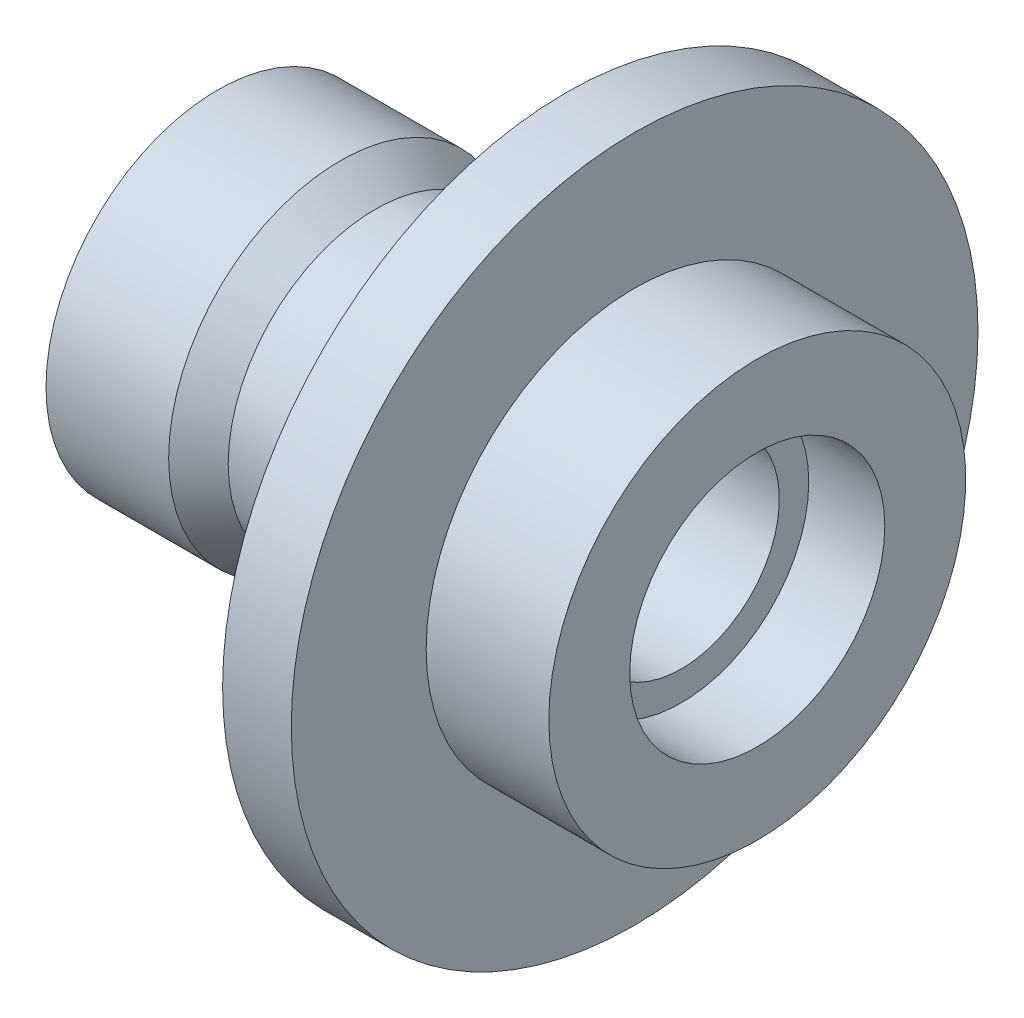
ISO-10303-21;
HEADER;
FILE_DESCRIPTION(('STEP AP214'),'2;1');
FILE_NAME('part.step','',(''),(''),'','','');
FILE_SCHEMA(('AUTOMOTIVE_DESIGN { 1 0 10303 214 1 1 1 1 }'));
ENDSEC;
DATA;
#1=APPLICATION_CONTEXT('core data for automotive mechanical design processes');
#2=APPLICATION_PROTOCOL_DEFINITION('international standard','automotive_design',2000,#1);
#3=PRODUCT_CONTEXT('',#1,'mechanical');
#4=PRODUCT('Part','Part','',(#3));
#5=PRODUCT_RELATED_PRODUCT_CATEGORY('part','',(#4));
#6=PRODUCT_DEFINITION_FORMATION('','',#4);
#7=PRODUCT_DEFINITION_CONTEXT('part definition',#1,'design');
#8=PRODUCT_DEFINITION('design','',#6,#7);
#9=PRODUCT_DEFINITION_SHAPE('','',#8);
#10=(LENGTH_UNIT() NAMED_UNIT(*) SI_UNIT(.MILLI.,.METRE.));
#11=(NAMED_UNIT(*) PLANE_ANGLE_UNIT() SI_UNIT($,.RADIAN.));
#12=(NAMED_UNIT(*) SI_UNIT($,.STERADIAN.) SOLID_ANGLE_UNIT());
#13=UNCERTAINTY_MEASURE_WITH_UNIT(LENGTH_MEASURE(1.E-05),#10,'distance_accuracy_value','');
#14=(GEOMETRIC_REPRESENTATION_CONTEXT(3) GLOBAL_UNCERTAINTY_ASSIGNED_CONTEXT((#13)) GLOBAL_UNIT_ASSIGNED_CONTEXT((#10,
#11,#12)) REPRESENTATION_CONTEXT('',''));
#15=CARTESIAN_POINT('',(0.,0.,0.));
#16=DIRECTION('',(0.,0.,1.));
#17=DIRECTION('',(1.,0.,0.));
#18=AXIS2_PLACEMENT_3D('',#15,#16,#17);
#19=CARTESIAN_POINT('',(0.,0.,0.));
#20=DIRECTION('',(-1.,0.,0.));
#21=DIRECTION('',(0.,0.,1.));
#22=AXIS2_PLACEMENT_3D('',#19,#20,#21);
#23=CYLINDRICAL_SURFACE('',#22,23.5);
#24=CARTESIAN_POINT('',(-27.2254716981132,0.,0.));
#25=DIRECTION('',(-1.,0.,0.));
#26=DIRECTION('',(0.,0.,1.));
#27=AXIS2_PLACEMENT_3D('',#24,#25,#26);
#28=CIRCLE('',#27,23.5);
#29=CARTESIAN_POINT('',(-27.2254716981132,0.,23.5));
#30=VERTEX_POINT('',#29);
#31=EDGE_CURVE('E56',#30,#30,#28,.T.);
#32=ORIENTED_EDGE('',*,*,#31,.F.);
#33=EDGE_LOOP('',(#32));
#34=FACE_BOUND('',#33,.T.);
#35=CARTESIAN_POINT('',(-41.2254716981132,0.,0.));
#36=DIRECTION('',(-1.,0.,0.));
#37=DIRECTION('',(0.,0.,1.));
#38=AXIS2_PLACEMENT_3D('',#35,#36,#37);
#39=CIRCLE('',#38,23.5);
#40=CARTESIAN_POINT('',(-41.2254716981132,0.,23.5));
#41=VERTEX_POINT('',#40);
#42=EDGE_CURVE('E122',#41,#41,#39,.T.);
#43=ORIENTED_EDGE('',*,*,#42,.T.);
#44=EDGE_LOOP('',(#43));
#45=FACE_BOUND('',#44,.T.);
#46=ADVANCED_FACE('F40',(#34,#45),#23,.F.);
#47=CARTESIAN_POINT('',(-27.2254716981132,0.,0.));
#48=DIRECTION('',(1.,0.,0.));
#49=DIRECTION('',(0.,0.,-1.));
#50=AXIS2_PLACEMENT_3D('',#47,#48,#49);
#51=PLANE('',#50);
#52=CARTESIAN_POINT('',(-27.2254716981132,0.,0.));
#53=DIRECTION('',(-1.,0.,0.));
#54=DIRECTION('',(0.,0.,1.));
#55=AXIS2_PLACEMENT_3D('',#52,#53,#54);
#56=CIRCLE('',#55,20.);
#57=CARTESIAN_POINT('',(-27.2254716981132,0.,20.));
#58=VERTEX_POINT('',#57);
#59=EDGE_CURVE('E64',#58,#58,#56,.T.);
#60=ORIENTED_EDGE('',*,*,#59,.F.);
#61=EDGE_LOOP('',(#60));
#62=FACE_BOUND('',#61,.T.);
#63=ORIENTED_EDGE('',*,*,#31,.T.);
#64=EDGE_LOOP('',(#63));
#65=FACE_BOUND('',#64,.T.);
#66=ADVANCED_FACE('F181',(#62,#65),#51,.F.);
#67=CARTESIAN_POINT('',(0.,0.,0.));
#68=DIRECTION('',(-1.,0.,0.));
#69=DIRECTION('',(0.,0.,1.));
#70=AXIS2_PLACEMENT_3D('',#67,#68,#69);
#71=CYLINDRICAL_SURFACE('',#70,20.);
#72=CARTESIAN_POINT('',(49.4245283018868,0.,0.));
#73=DIRECTION('',(-1.,0.,0.));
#74=DIRECTION('',(0.,0.,1.));
#75=AXIS2_PLACEMENT_3D('',#72,#73,#74);
#76=CIRCLE('',#75,20.);
#77=CARTESIAN_POINT('',(49.4245283018868,0.,20.));
#78=VERTEX_POINT('',#77);
#79=EDGE_CURVE('E70',#78,#78,#76,.T.);
#80=ORIENTED_EDGE('',*,*,#79,.F.);
#81=EDGE_LOOP('',(#80));
#82=FACE_BOUND('',#81,.T.);
#83=ORIENTED_EDGE('',*,*,#59,.T.);
#84=EDGE_LOOP('',(#83));
#85=FACE_BOUND('',#84,.T.);
#86=ADVANCED_FACE('F186',(#82,#85),#71,.F.);
#87=CARTESIAN_POINT('',(49.4245283018868,0.,0.));
#88=DIRECTION('',(-1.,0.,0.));
#89=DIRECTION('',(0.,0.,1.));
#90=AXIS2_PLACEMENT_3D('',#87,#88,#89);
#91=PLANE('',#90);
#92=CARTESIAN_POINT('',(49.4245283018868,0.,0.));
#93=DIRECTION('',(-1.,0.,0.));
#94=DIRECTION('',(0.,0.,1.));
#95=AXIS2_PLACEMENT_3D('',#92,#93,#94);
#96=CIRCLE('',#95,26.);
#97=CARTESIAN_POINT('',(49.4245283018868,0.,26.));
#98=VERTEX_POINT('',#97);
#99=EDGE_CURVE('E74',#98,#98,#96,.T.);
#100=ORIENTED_EDGE('',*,*,#99,.F.);
#101=EDGE_LOOP('',(#100));
#102=FACE_BOUND('',#101,.T.);
#103=ORIENTED_EDGE('',*,*,#79,.T.);
#104=EDGE_LOOP('',(#103));
#105=FACE_BOUND('',#104,.T.);
#106=ADVANCED_FACE('F193',(#102,#105),#91,.F.);
#107=CARTESIAN_POINT('',(0.,0.,0.));
#108=DIRECTION('',(-1.,0.,0.));
#109=DIRECTION('',(0.,0.,1.));
#110=AXIS2_PLACEMENT_3D('',#107,#108,#109);
#111=CYLINDRICAL_SURFACE('',#110,26.);
#112=CARTESIAN_POINT('',(64.9245283018868,0.,0.));
#113=DIRECTION('',(-1.,0.,0.));
#114=DIRECTION('',(0.,0.,1.));
#115=AXIS2_PLACEMENT_3D('',#112,#113,#114);
#116=CIRCLE('',#115,26.);
#117=CARTESIAN_POINT('',(64.9245283018868,0.,26.));
#118=VERTEX_POINT('',#117);
#119=EDGE_CURVE('E77',#118,#118,#116,.T.);
#120=ORIENTED_EDGE('',*,*,#119,.F.);
#121=EDGE_LOOP('',(#120));
#122=FACE_BOUND('',#121,.T.);
#123=ORIENTED_EDGE('',*,*,#99,.T.);
#124=EDGE_LOOP('',(#123));
#125=FACE_BOUND('',#124,.T.);
#126=ADVANCED_FACE('F197',(#122,#125),#111,.F.);
#127=CARTESIAN_POINT('',(64.9245283018868,0.,0.));
#128=DIRECTION('',(-1.,0.,0.));
#129=DIRECTION('',(0.,0.,1.));
#130=AXIS2_PLACEMENT_3D('',#127,#128,#129);
#131=PLANE('',#130);
#132=CARTESIAN_POINT('',(64.9245283018868,0.,0.));
#133=DIRECTION('',(-1.,0.,0.));
#134=DIRECTION('',(0.,0.,1.));
#135=AXIS2_PLACEMENT_3D('',#132,#133,#134);
#136=CIRCLE('',#135,42.5);
#137=CARTESIAN_POINT('',(64.9245283018868,0.,42.5));
#138=VERTEX_POINT('',#137);
#139=EDGE_CURVE('E80',#138,#138,#136,.T.);
#140=ORIENTED_EDGE('',*,*,#139,.F.);
#141=EDGE_LOOP('',(#140));
#142=FACE_BOUND('',#141,.T.);
#143=ORIENTED_EDGE('',*,*,#119,.T.);
#144=EDGE_LOOP('',(#143));
#145=FACE_BOUND('',#144,.T.);
#146=ADVANCED_FACE('F201',(#142,#145),#131,.F.);
#147=CARTESIAN_POINT('',(0.,0.,0.));
#148=DIRECTION('',(-1.,0.,0.));
#149=DIRECTION('',(0.,0.,1.));
#150=AXIS2_PLACEMENT_3D('',#147,#148,#149);
#151=CYLINDRICAL_SURFACE('',#150,42.5);
#152=CARTESIAN_POINT('',(39.9245283018868,0.,0.));
#153=DIRECTION('',(-1.,0.,0.));
#154=DIRECTION('',(0.,0.,1.));
#155=AXIS2_PLACEMENT_3D('',#152,#153,#154);
#156=CIRCLE('',#155,42.5);
#157=CARTESIAN_POINT('',(39.9245283018868,0.,42.5));
#158=VERTEX_POINT('',#157);
#159=EDGE_CURVE('E83',#158,#158,#156,.T.);
#160=ORIENTED_EDGE('',*,*,#159,.F.);
#161=EDGE_LOOP('',(#160));
#162=FACE_BOUND('',#161,.T.);
#163=ORIENTED_EDGE('',*,*,#139,.T.);
#164=EDGE_LOOP('',(#163));
#165=FACE_BOUND('',#164,.T.);
#166=ADVANCED_FACE('F205',(#162,#165),#151,.T.);
#167=CARTESIAN_POINT('',(39.9245283018868,0.,0.));
#168=DIRECTION('',(-1.,0.,0.));
#169=DIRECTION('',(0.,0.,1.));
#170=AXIS2_PLACEMENT_3D('',#167,#168,#169);
#171=PLANE('',#170);
#172=CARTESIAN_POINT('',(39.9245283018868,0.,0.));
#173=DIRECTION('',(-1.,0.,0.));
#174=DIRECTION('',(0.,0.,1.));
#175=AXIS2_PLACEMENT_3D('',#172,#173,#174);
#176=CIRCLE('',#175,70.);
#177=CARTESIAN_POINT('',(39.9245283018868,0.,70.));
#178=VERTEX_POINT('',#177);
#179=EDGE_CURVE('E86',#178,#178,#176,.T.);
#180=ORIENTED_EDGE('',*,*,#179,.F.);
#181=EDGE_LOOP('',(#180));
#182=FACE_BOUND('',#181,.T.);
#183=ORIENTED_EDGE('',*,*,#159,.T.);
#184=EDGE_LOOP('',(#183));
#185=FACE_BOUND('',#184,.T.);
#186=ADVANCED_FACE('F209',(#182,#185),#171,.F.);
#187=CARTESIAN_POINT('',(0.,0.,0.));
#188=DIRECTION('',(-1.,0.,0.));
#189=DIRECTION('',(0.,0.,1.));
#190=AXIS2_PLACEMENT_3D('',#187,#188,#189);
#191=CYLINDRICAL_SURFACE('',#190,70.);
#192=CARTESIAN_POINT('',(25.9245283018868,0.,0.));
#193=DIRECTION('',(-1.,0.,0.));
#194=DIRECTION('',(0.,0.,1.));
#195=AXIS2_PLACEMENT_3D('',#192,#193,#194);
#196=CIRCLE('',#195,70.);
#197=CARTESIAN_POINT('',(25.9245283018868,0.,70.));
#198=VERTEX_POINT('',#197);
#199=EDGE_CURVE('E90',#198,#198,#196,.T.);
#200=ORIENTED_EDGE('',*,*,#199,.F.);
#201=EDGE_LOOP('',(#200));
#202=FACE_BOUND('',#201,.T.);
#203=ORIENTED_EDGE('',*,*,#179,.T.);
#204=EDGE_LOOP('',(#203));
#205=FACE_BOUND('',#204,.T.);
#206=ADVANCED_FACE('F178',(#202,#205),#191,.T.);
#207=CARTESIAN_POINT('',(25.9245283018868,0.,0.));
#208=DIRECTION('',(1.,0.,0.));
#209=DIRECTION('',(0.,0.,-1.));
#210=AXIS2_PLACEMENT_3D('',#207,#208,#209);
#211=PLANE('',#210);
#212=CARTESIAN_POINT('',(25.9245283018868,0.,0.));
#213=DIRECTION('',(1.,0.,0.));
#214=DIRECTION('',(0.,0.,-1.));
#215=AXIS2_PLACEMENT_3D('',#212,#213,#214);
#216=CIRCLE('',#215,33.);
#217=CARTESIAN_POINT('',(25.9245283018868,0.,-33.));
#218=VERTEX_POINT('',#217);
#219=EDGE_CURVE('E10',#218,#218,#216,.T.);
#220=ORIENTED_EDGE('',*,*,#219,.T.);
#221=EDGE_LOOP('',(#220));
#222=FACE_BOUND('',#221,.T.);
#223=ORIENTED_EDGE('',*,*,#199,.T.);
#224=EDGE_LOOP('',(#223));
#225=FACE_BOUND('',#224,.T.);
#226=ADVANCED_FACE('F173',(#222,#225),#211,.F.);
#227=CARTESIAN_POINT('',(0.,0.,0.));
#228=DIRECTION('',(-1.,0.,0.));
#229=DIRECTION('',(0.,0.,1.));
#230=AXIS2_PLACEMENT_3D('',#227,#228,#229);
#231=CYLINDRICAL_SURFACE('',#230,30.);
#232=CARTESIAN_POINT('',(22.9245283018868,0.,0.));
#233=DIRECTION('',(1.,0.,0.));
#234=DIRECTION('',(0.,0.,-1.));
#235=AXIS2_PLACEMENT_3D('',#232,#233,#234);
#236=CIRCLE('',#235,30.);
#237=CARTESIAN_POINT('',(22.9245283018868,0.,-30.));
#238=VERTEX_POINT('',#237);
#239=EDGE_CURVE('E48',#238,#238,#236,.F.);
#240=ORIENTED_EDGE('',*,*,#239,.T.);
#241=EDGE_LOOP('',(#240));
#242=FACE_BOUND('',#241,.T.);
#243=CARTESIAN_POINT('',(-12.9347316644025,0.,0.));
#244=DIRECTION('',(-1.,0.,0.));
#245=DIRECTION('',(0.,0.,1.));
#246=AXIS2_PLACEMENT_3D('',#243,#244,#245);
#247=CIRCLE('',#246,30.);
#248=CARTESIAN_POINT('',(-12.9347316644025,0.,30.));
#249=VERTEX_POINT('',#248);
#250=EDGE_CURVE('E94',#249,#249,#247,.T.);
#251=ORIENTED_EDGE('',*,*,#250,.F.);
#252=EDGE_LOOP('',(#251));
#253=FACE_BOUND('',#252,.T.);
#254=ADVANCED_FACE('F168',(#242,#253),#231,.T.);
#255=CARTESIAN_POINT('',(-12.9347316644025,0.,0.));
#256=DIRECTION('',(-1.,0.,0.));
#257=DIRECTION('',(0.,0.,1.));
#258=AXIS2_PLACEMENT_3D('',#255,#256,#257);
#259=CONICAL_SURFACE('',#258,30.,0.610865238198009);
#260=CARTESIAN_POINT('',(-20.0754716981132,0.,0.));
#261=DIRECTION('',(-1.,0.,0.));
#262=DIRECTION('',(0.,0.,1.));
#263=AXIS2_PLACEMENT_3D('',#260,#261,#262);
#264=CIRCLE('',#263,35.);
#265=CARTESIAN_POINT('',(-20.0754716981132,0.,35.));
#266=VERTEX_POINT('',#265);
#267=EDGE_CURVE('E98',#266,#266,#264,.T.);
#268=ORIENTED_EDGE('',*,*,#267,.F.);
#269=EDGE_LOOP('',(#268));
#270=FACE_BOUND('',#269,.T.);
#271=ORIENTED_EDGE('',*,*,#250,.T.);
#272=EDGE_LOOP('',(#271));
#273=FACE_BOUND('',#272,.T.);
#274=ADVANCED_FACE('F162',(#270,#273),#259,.T.);
#275=CARTESIAN_POINT('',(0.,0.,0.));
#276=DIRECTION('',(-1.,0.,0.));
#277=DIRECTION('',(0.,0.,1.));
#278=AXIS2_PLACEMENT_3D('',#275,#276,#277);
#279=CYLINDRICAL_SURFACE('',#278,35.);
#280=CARTESIAN_POINT('',(-45.0754716981132,0.,0.));
#281=DIRECTION('',(-1.,0.,0.));
#282=DIRECTION('',(0.,0.,1.));
#283=AXIS2_PLACEMENT_3D('',#280,#281,#282);
#284=CIRCLE('',#283,35.);
#285=CARTESIAN_POINT('',(-45.0754716981132,0.,35.));
#286=VERTEX_POINT('',#285);
#287=EDGE_CURVE('E102',#286,#286,#284,.T.);
#288=ORIENTED_EDGE('',*,*,#287,.F.);
#289=EDGE_LOOP('',(#288));
#290=FACE_BOUND('',#289,.T.);
#291=ORIENTED_EDGE('',*,*,#267,.T.);
#292=EDGE_LOOP('',(#291));
#293=FACE_BOUND('',#292,.T.);
#294=ADVANCED_FACE('F156',(#290,#293),#279,.T.);
#295=CARTESIAN_POINT('',(-45.0754716981132,0.,0.));
#296=DIRECTION('',(1.,0.,0.));
#297=DIRECTION('',(0.,0.,-1.));
#298=AXIS2_PLACEMENT_3D('',#295,#296,#297);
#299=PLANE('',#298);
#300=CARTESIAN_POINT('',(-45.0754716981132,0.,0.));
#301=DIRECTION('',(-1.,0.,0.));
#302=DIRECTION('',(0.,0.,1.));
#303=AXIS2_PLACEMENT_3D('',#300,#301,#302);
#304=CIRCLE('',#303,23.5);
#305=CARTESIAN_POINT('',(-45.0754716981132,0.,23.5));
#306=VERTEX_POINT('',#305);
#307=EDGE_CURVE('E106',#306,#306,#304,.T.);
#308=ORIENTED_EDGE('',*,*,#307,.F.);
#309=EDGE_LOOP('',(#308));
#310=FACE_BOUND('',#309,.T.);
#311=ORIENTED_EDGE('',*,*,#287,.T.);
#312=EDGE_LOOP('',(#311));
#313=FACE_BOUND('',#312,.T.);
#314=ADVANCED_FACE('F150',(#310,#313),#299,.F.);
#315=CARTESIAN_POINT('',(0.,0.,0.));
#316=DIRECTION('',(-1.,0.,0.));
#317=DIRECTION('',(0.,0.,1.));
#318=AXIS2_PLACEMENT_3D('',#315,#316,#317);
#319=CYLINDRICAL_SURFACE('',#318,23.5);
#320=CARTESIAN_POINT('',(-43.0754716981132,0.,0.));
#321=DIRECTION('',(-1.,0.,0.));
#322=DIRECTION('',(0.,0.,1.));
#323=AXIS2_PLACEMENT_3D('',#320,#321,#322);
#324=CIRCLE('',#323,23.5);
#325=CARTESIAN_POINT('',(-43.0754716981132,0.,23.5));
#326=VERTEX_POINT('',#325);
#327=EDGE_CURVE('E110',#326,#326,#324,.T.);
#328=ORIENTED_EDGE('',*,*,#327,.F.);
#329=EDGE_LOOP('',(#328));
#330=FACE_BOUND('',#329,.T.);
#331=ORIENTED_EDGE('',*,*,#307,.T.);
#332=EDGE_LOOP('',(#331));
#333=FACE_BOUND('',#332,.T.);
#334=ADVANCED_FACE('F144',(#330,#333),#319,.F.);
#335=CARTESIAN_POINT('',(-43.0754716981132,0.,0.));
#336=DIRECTION('',(-1.,0.,0.));
#337=DIRECTION('',(0.,0.,1.));
#338=AXIS2_PLACEMENT_3D('',#335,#336,#337);
#339=PLANE('',#338);
#340=CARTESIAN_POINT('',(-43.0754716981132,0.,0.));
#341=DIRECTION('',(-1.,0.,0.));
#342=DIRECTION('',(0.,0.,1.));
#343=AXIS2_PLACEMENT_3D('',#340,#341,#342);
#344=CIRCLE('',#343,24.75);
#345=CARTESIAN_POINT('',(-43.0754716981132,0.,24.75));
#346=VERTEX_POINT('',#345);
#347=EDGE_CURVE('E114',#346,#346,#344,.T.);
#348=ORIENTED_EDGE('',*,*,#347,.F.);
#349=EDGE_LOOP('',(#348));
#350=FACE_BOUND('',#349,.T.);
#351=ORIENTED_EDGE('',*,*,#327,.T.);
#352=EDGE_LOOP('',(#351));
#353=FACE_BOUND('',#352,.T.);
#354=ADVANCED_FACE('F138',(#350,#353),#339,.F.);
#355=CARTESIAN_POINT('',(0.,0.,0.));
#356=DIRECTION('',(-1.,0.,0.));
#357=DIRECTION('',(0.,0.,1.));
#358=AXIS2_PLACEMENT_3D('',#355,#356,#357);
#359=CYLINDRICAL_SURFACE('',#358,24.75);
#360=CARTESIAN_POINT('',(-41.2254716981132,0.,0.));
#361=DIRECTION('',(-1.,0.,0.));
#362=DIRECTION('',(0.,0.,1.));
#363=AXIS2_PLACEMENT_3D('',#360,#361,#362);
#364=CIRCLE('',#363,24.75);
#365=CARTESIAN_POINT('',(-41.2254716981132,0.,24.75));
#366=VERTEX_POINT('',#365);
#367=EDGE_CURVE('E118',#366,#366,#364,.T.);
#368=ORIENTED_EDGE('',*,*,#367,.F.);
#369=EDGE_LOOP('',(#368));
#370=FACE_BOUND('',#369,.T.);
#371=ORIENTED_EDGE('',*,*,#347,.T.);
#372=EDGE_LOOP('',(#371));
#373=FACE_BOUND('',#372,.T.);
#374=ADVANCED_FACE('F132',(#370,#373),#359,.F.);
#375=CARTESIAN_POINT('',(-41.2254716981132,-2.28847339401389E-13,0.));
#376=DIRECTION('',(1.,0.,0.));
#377=DIRECTION('',(0.,0.,-1.));
#378=AXIS2_PLACEMENT_3D('',#375,#376,#377);
#379=PLANE('',#378);
#380=ORIENTED_EDGE('',*,*,#42,.F.);
#381=EDGE_LOOP('',(#380));
#382=FACE_BOUND('',#381,.T.);
#383=ORIENTED_EDGE('',*,*,#367,.T.);
#384=EDGE_LOOP('',(#383));
#385=FACE_BOUND('',#384,.T.);
#386=ADVANCED_FACE('F129',(#382,#385),#379,.F.);
#387=CARTESIAN_POINT('',(22.9245283018868,0.,0.));
#388=DIRECTION('',(1.,0.,0.));
#389=DIRECTION('',(0.,0.,-1.));
#390=AXIS2_PLACEMENT_3D('',#387,#388,#389);
#391=TOROIDAL_SURFACE('',#390,33.,3.);
#392=ORIENTED_EDGE('',*,*,#219,.F.);
#393=EDGE_LOOP('',(#392));
#394=FACE_BOUND('',#393,.T.);
#395=ORIENTED_EDGE('',*,*,#239,.F.);
#396=EDGE_LOOP('',(#395));
#397=FACE_BOUND('',#396,.T.);
#398=ADVANCED_FACE('F42',(#394,#397),#391,.F.);
#399=CLOSED_SHELL('',(#46,#66,#86,#106,#126,#146,#166,#186,#206,#226,#254,#274,#294,#314,#334,
#354,#374,#386,#398));
#400=MANIFOLD_SOLID_BREP('B2',#399);
#401=ADVANCED_BREP_SHAPE_REPRESENTATION('',(#18,#400),#14);
#402=SHAPE_DEFINITION_REPRESENTATION(#9,#401);
ENDSEC;
END-ISO-10303-21;
